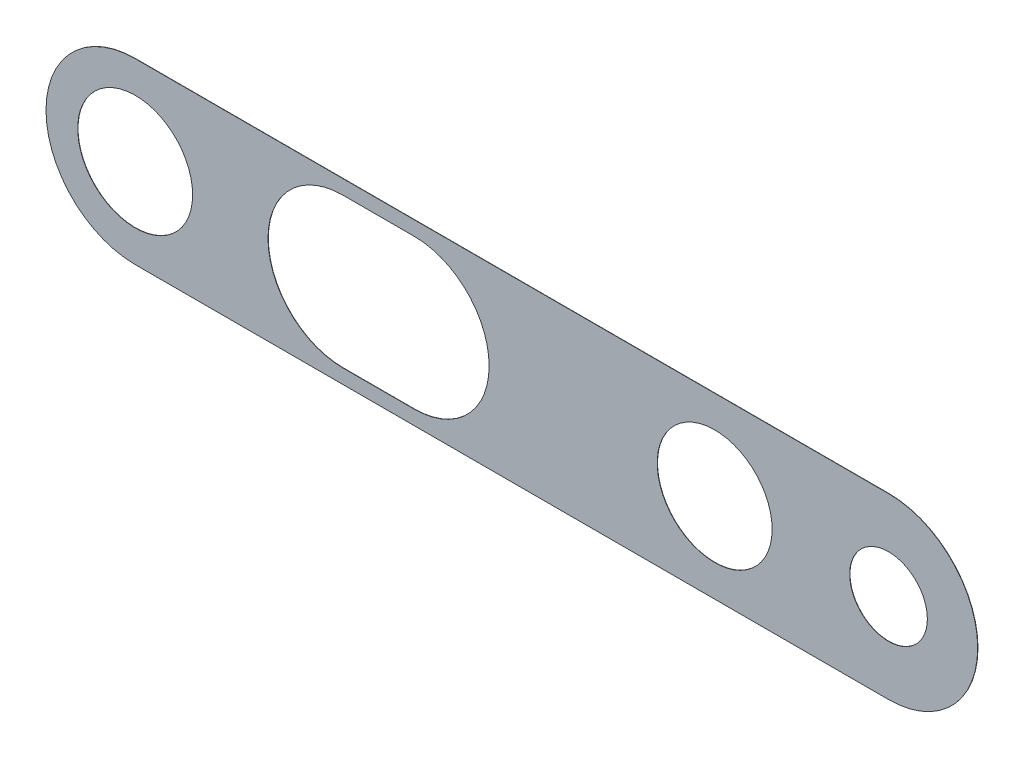
ISO-10303-21;
HEADER;
FILE_DESCRIPTION(('STEP AP214'),'2;1');
FILE_NAME('part.step','',(''),(''),'','','');
FILE_SCHEMA(('AUTOMOTIVE_DESIGN { 1 0 10303 214 1 1 1 1 }'));
ENDSEC;
DATA;
#1=APPLICATION_CONTEXT('core data for automotive mechanical design processes');
#2=APPLICATION_PROTOCOL_DEFINITION('international standard','automotive_design',2000,#1);
#3=PRODUCT_CONTEXT('',#1,'mechanical');
#4=PRODUCT('Part','Part','',(#3));
#5=PRODUCT_RELATED_PRODUCT_CATEGORY('part','',(#4));
#6=PRODUCT_DEFINITION_FORMATION('','',#4);
#7=PRODUCT_DEFINITION_CONTEXT('part definition',#1,'design');
#8=PRODUCT_DEFINITION('design','',#6,#7);
#9=PRODUCT_DEFINITION_SHAPE('','',#8);
#10=(LENGTH_UNIT() NAMED_UNIT(*) SI_UNIT(.MILLI.,.METRE.));
#11=(NAMED_UNIT(*) PLANE_ANGLE_UNIT() SI_UNIT($,.RADIAN.));
#12=(NAMED_UNIT(*) SI_UNIT($,.STERADIAN.) SOLID_ANGLE_UNIT());
#13=UNCERTAINTY_MEASURE_WITH_UNIT(LENGTH_MEASURE(1.E-05),#10,'distance_accuracy_value','');
#14=(GEOMETRIC_REPRESENTATION_CONTEXT(3) GLOBAL_UNCERTAINTY_ASSIGNED_CONTEXT((#13)) GLOBAL_UNIT_ASSIGNED_CONTEXT((#10,
#11,#12)) REPRESENTATION_CONTEXT('',''));
#15=CARTESIAN_POINT('',(0.,0.,0.));
#16=DIRECTION('',(0.,0.,1.));
#17=DIRECTION('',(1.,0.,0.));
#18=AXIS2_PLACEMENT_3D('',#15,#16,#17);
#19=CARTESIAN_POINT('',(0.,0.,-0.65));
#20=DIRECTION('',(0.,0.,1.));
#21=DIRECTION('',(1.,0.,0.));
#22=AXIS2_PLACEMENT_3D('',#19,#20,#21);
#23=PLANE('',#22);
#24=DIRECTION('',(1.,0.,0.));
#25=VECTOR('',#24,1.);
#26=CARTESIAN_POINT('',(-14.58342148133,-6.455,-0.65));
#27=LINE('',#26,#25);
#28=CARTESIAN_POINT('',(-8.416578518674,-6.455,-0.65));
#29=VERTEX_POINT('',#28);
#30=CARTESIAN_POINT('',(-14.58342148133,-6.455,-0.65));
#31=VERTEX_POINT('',#30);
#32=EDGE_CURVE('E149',#29,#31,#27,.F.);
#33=ORIENTED_EDGE('',*,*,#32,.T.);
#34=CARTESIAN_POINT('',(-14.58342148133,0.,-0.65));
#35=DIRECTION('',(0.,0.,1.));
#36=DIRECTION('',(1.,0.,0.));
#37=AXIS2_PLACEMENT_3D('',#34,#35,#36);
#38=CIRCLE('',#37,6.455);
#39=CARTESIAN_POINT('',(-14.58342148133,6.455,-0.65));
#40=VERTEX_POINT('',#39);
#41=EDGE_CURVE('E136',#31,#40,#38,.F.);
#42=ORIENTED_EDGE('',*,*,#41,.T.);
#43=DIRECTION('',(1.,0.,0.));
#44=VECTOR('',#43,1.);
#45=CARTESIAN_POINT('',(-8.416578518674,6.455,-0.65));
#46=LINE('',#45,#44);
#47=CARTESIAN_POINT('',(-8.416578518674,6.455,-0.65));
#48=VERTEX_POINT('',#47);
#49=EDGE_CURVE('E107',#40,#48,#46,.T.);
#50=ORIENTED_EDGE('',*,*,#49,.T.);
#51=CARTESIAN_POINT('',(-8.416578518674,0.,-0.65));
#52=DIRECTION('',(0.,0.,1.));
#53=DIRECTION('',(1.,0.,0.));
#54=AXIS2_PLACEMENT_3D('',#51,#52,#53);
#55=CIRCLE('',#54,6.455);
#56=EDGE_CURVE('E131',#48,#29,#55,.F.);
#57=ORIENTED_EDGE('',*,*,#56,.T.);
#58=EDGE_LOOP('',(#33,#42,#50,#57));
#59=FACE_BOUND('',#58,.T.);
#60=CARTESIAN_POINT('',(32.5,0.,-0.65));
#61=DIRECTION('',(0.,0.,1.));
#62=DIRECTION('',(1.,0.,0.));
#63=AXIS2_PLACEMENT_3D('',#60,#61,#62);
#64=CIRCLE('',#63,3.350253178006);
#65=CARTESIAN_POINT('',(35.850253178006,0.,-0.65));
#66=VERTEX_POINT('',#65);
#67=EDGE_CURVE('E139',#66,#66,#64,.F.);
#68=ORIENTED_EDGE('',*,*,#67,.T.);
#69=EDGE_LOOP('',(#68));
#70=FACE_BOUND('',#69,.T.);
#71=CARTESIAN_POINT('',(17.5,0.,-0.65));
#72=DIRECTION('',(0.,0.,1.));
#73=DIRECTION('',(1.,0.,0.));
#74=AXIS2_PLACEMENT_3D('',#71,#72,#73);
#75=CIRCLE('',#74,4.956671541071);
#76=CARTESIAN_POINT('',(22.456671541071,0.,-0.65));
#77=VERTEX_POINT('',#76);
#78=EDGE_CURVE('E103',#77,#77,#75,.F.);
#79=ORIENTED_EDGE('',*,*,#78,.T.);
#80=EDGE_LOOP('',(#79));
#81=FACE_BOUND('',#80,.T.);
#82=CARTESIAN_POINT('',(-32.5,0.,-0.65));
#83=DIRECTION('',(0.,0.,1.));
#84=DIRECTION('',(1.,0.,0.));
#85=AXIS2_PLACEMENT_3D('',#82,#83,#84);
#86=CIRCLE('',#85,4.956671541071);
#87=CARTESIAN_POINT('',(-27.543328458929,0.,-0.65));
#88=VERTEX_POINT('',#87);
#89=EDGE_CURVE('E100',#88,#88,#86,.F.);
#90=ORIENTED_EDGE('',*,*,#89,.T.);
#91=EDGE_LOOP('',(#90));
#92=FACE_BOUND('',#91,.T.);
#93=CARTESIAN_POINT('',(32.5,0.,-0.65));
#94=DIRECTION('',(0.,0.,1.));
#95=DIRECTION('',(1.,0.,0.));
#96=AXIS2_PLACEMENT_3D('',#93,#94,#95);
#97=CIRCLE('',#96,7.695);
#98=CARTESIAN_POINT('',(32.5,7.695,-0.65));
#99=VERTEX_POINT('',#98);
#100=CARTESIAN_POINT('',(32.5,-7.695,-0.65));
#101=VERTEX_POINT('',#100);
#102=EDGE_CURVE('E20',#99,#101,#97,.F.);
#103=ORIENTED_EDGE('',*,*,#102,.F.);
#104=DIRECTION('',(1.,0.,0.));
#105=VECTOR('',#104,1.);
#106=CARTESIAN_POINT('',(32.5,7.695,-0.65));
#107=LINE('',#106,#105);
#108=CARTESIAN_POINT('',(-32.5,7.695,-0.65));
#109=VERTEX_POINT('',#108);
#110=EDGE_CURVE('E109',#109,#99,#107,.T.);
#111=ORIENTED_EDGE('',*,*,#110,.F.);
#112=CARTESIAN_POINT('',(-32.5,0.,-0.65));
#113=DIRECTION('',(0.,0.,1.));
#114=DIRECTION('',(1.,0.,0.));
#115=AXIS2_PLACEMENT_3D('',#112,#113,#114);
#116=CIRCLE('',#115,7.695);
#117=CARTESIAN_POINT('',(-32.5,-7.695,-0.65));
#118=VERTEX_POINT('',#117);
#119=EDGE_CURVE('E99',#118,#109,#116,.F.);
#120=ORIENTED_EDGE('',*,*,#119,.F.);
#121=DIRECTION('',(1.,0.,0.));
#122=VECTOR('',#121,1.);
#123=CARTESIAN_POINT('',(-32.5,-7.695,-0.65));
#124=LINE('',#123,#122);
#125=EDGE_CURVE('E92',#101,#118,#124,.F.);
#126=ORIENTED_EDGE('',*,*,#125,.F.);
#127=EDGE_LOOP('',(#103,#111,#120,#126));
#128=FACE_BOUND('',#127,.T.);
#129=ADVANCED_FACE('F17',(#59,#70,#81,#92,#128),#23,.T.);
#130=CARTESIAN_POINT('',(32.5,0.,-0.65));
#131=DIRECTION('',(0.,0.,1.));
#132=DIRECTION('',(1.,0.,0.));
#133=AXIS2_PLACEMENT_3D('',#130,#131,#132);
#134=CYLINDRICAL_SURFACE('',#133,7.695);
#135=DIRECTION('',(0.,0.,1.));
#136=VECTOR('',#135,1.);
#137=CARTESIAN_POINT('',(32.5,7.695,-0.65));
#138=LINE('',#137,#136);
#139=CARTESIAN_POINT('',(32.5,7.695,-0.675));
#140=VERTEX_POINT('',#139);
#141=EDGE_CURVE('E84',#99,#140,#138,.F.);
#142=ORIENTED_EDGE('',*,*,#141,.F.);
#143=ORIENTED_EDGE('',*,*,#102,.T.);
#144=DIRECTION('',(0.,0.,-1.));
#145=VECTOR('',#144,1.);
#146=CARTESIAN_POINT('',(32.5,-7.695,-0.65));
#147=LINE('',#146,#145);
#148=CARTESIAN_POINT('',(32.5,-7.695,-0.675));
#149=VERTEX_POINT('',#148);
#150=EDGE_CURVE('E81',#149,#101,#147,.F.);
#151=ORIENTED_EDGE('',*,*,#150,.F.);
#152=CARTESIAN_POINT('',(32.5,0.,-0.675));
#153=DIRECTION('',(0.,0.,1.));
#154=DIRECTION('',(1.,0.,0.));
#155=AXIS2_PLACEMENT_3D('',#152,#153,#154);
#156=CIRCLE('',#155,7.695);
#157=EDGE_CURVE('E128',#149,#140,#156,.T.);
#158=ORIENTED_EDGE('',*,*,#157,.T.);
#159=EDGE_LOOP('',(#142,#143,#151,#158));
#160=FACE_BOUND('',#159,.T.);
#161=ADVANCED_FACE('F80',(#160),#134,.T.);
#162=CARTESIAN_POINT('',(32.5,7.695,-0.65));
#163=DIRECTION('',(0.,1.,0.));
#164=DIRECTION('',(0.,0.,1.));
#165=AXIS2_PLACEMENT_3D('',#162,#163,#164);
#166=PLANE('',#165);
#167=DIRECTION('',(0.,0.,1.));
#168=VECTOR('',#167,1.);
#169=CARTESIAN_POINT('',(-32.5,7.695,-0.65));
#170=LINE('',#169,#168);
#171=CARTESIAN_POINT('',(-32.5,7.695,-0.675));
#172=VERTEX_POINT('',#171);
#173=EDGE_CURVE('E111',#109,#172,#170,.F.);
#174=ORIENTED_EDGE('',*,*,#173,.F.);
#175=ORIENTED_EDGE('',*,*,#110,.T.);
#176=ORIENTED_EDGE('',*,*,#141,.T.);
#177=DIRECTION('',(1.,0.,0.));
#178=VECTOR('',#177,1.);
#179=CARTESIAN_POINT('',(0.,7.695,-0.675));
#180=LINE('',#179,#178);
#181=EDGE_CURVE('E127',#140,#172,#180,.F.);
#182=ORIENTED_EDGE('',*,*,#181,.T.);
#183=EDGE_LOOP('',(#174,#175,#176,#182));
#184=FACE_BOUND('',#183,.T.);
#185=ADVANCED_FACE('F270',(#184),#166,.T.);
#186=CARTESIAN_POINT('',(-32.5,0.,-0.65));
#187=DIRECTION('',(0.,0.,1.));
#188=DIRECTION('',(1.,0.,0.));
#189=AXIS2_PLACEMENT_3D('',#186,#187,#188);
#190=CYLINDRICAL_SURFACE('',#189,7.695);
#191=DIRECTION('',(0.,0.,-1.));
#192=VECTOR('',#191,1.);
#193=CARTESIAN_POINT('',(-32.5,-7.695,-0.65));
#194=LINE('',#193,#192);
#195=CARTESIAN_POINT('',(-32.5,-7.695,-0.675));
#196=VERTEX_POINT('',#195);
#197=EDGE_CURVE('E96',#118,#196,#194,.T.);
#198=ORIENTED_EDGE('',*,*,#197,.F.);
#199=ORIENTED_EDGE('',*,*,#119,.T.);
#200=ORIENTED_EDGE('',*,*,#173,.T.);
#201=CARTESIAN_POINT('',(-32.5,0.,-0.675));
#202=DIRECTION('',(0.,0.,1.));
#203=DIRECTION('',(1.,0.,0.));
#204=AXIS2_PLACEMENT_3D('',#201,#202,#203);
#205=CIRCLE('',#204,7.695);
#206=EDGE_CURVE('E125',#172,#196,#205,.T.);
#207=ORIENTED_EDGE('',*,*,#206,.T.);
#208=EDGE_LOOP('',(#198,#199,#200,#207));
#209=FACE_BOUND('',#208,.T.);
#210=ADVANCED_FACE('F262',(#209),#190,.T.);
#211=CARTESIAN_POINT('',(-32.5,-7.695,-0.65));
#212=DIRECTION('',(0.,-1.,0.));
#213=DIRECTION('',(0.,0.,-1.));
#214=AXIS2_PLACEMENT_3D('',#211,#212,#213);
#215=PLANE('',#214);
#216=ORIENTED_EDGE('',*,*,#150,.T.);
#217=ORIENTED_EDGE('',*,*,#125,.T.);
#218=ORIENTED_EDGE('',*,*,#197,.T.);
#219=DIRECTION('',(1.,0.,0.));
#220=VECTOR('',#219,1.);
#221=CARTESIAN_POINT('',(0.,-7.695,-0.675));
#222=LINE('',#221,#220);
#223=EDGE_CURVE('E95',#196,#149,#222,.T.);
#224=ORIENTED_EDGE('',*,*,#223,.T.);
#225=EDGE_LOOP('',(#216,#217,#218,#224));
#226=FACE_BOUND('',#225,.T.);
#227=ADVANCED_FACE('F90',(#226),#215,.T.);
#228=CARTESIAN_POINT('',(-32.5,0.,0.));
#229=DIRECTION('',(0.,0.,1.));
#230=DIRECTION('',(1.,0.,0.));
#231=AXIS2_PLACEMENT_3D('',#228,#229,#230);
#232=CYLINDRICAL_SURFACE('',#231,4.956671541071);
#233=CARTESIAN_POINT('',(-32.5,0.,-0.675));
#234=DIRECTION('',(0.,0.,1.));
#235=DIRECTION('',(1.,0.,0.));
#236=AXIS2_PLACEMENT_3D('',#233,#234,#235);
#237=CIRCLE('',#236,4.956671541071);
#238=CARTESIAN_POINT('',(-27.543328458929,0.,-0.675));
#239=VERTEX_POINT('',#238);
#240=EDGE_CURVE('E122',#239,#239,#237,.F.);
#241=ORIENTED_EDGE('',*,*,#240,.T.);
#242=EDGE_LOOP('',(#241));
#243=FACE_BOUND('',#242,.T.);
#244=ORIENTED_EDGE('',*,*,#89,.F.);
#245=EDGE_LOOP('',(#244));
#246=FACE_BOUND('',#245,.T.);
#247=ADVANCED_FACE('F245',(#243,#246),#232,.F.);
#248=CARTESIAN_POINT('',(17.5,0.,0.));
#249=DIRECTION('',(0.,0.,1.));
#250=DIRECTION('',(1.,0.,0.));
#251=AXIS2_PLACEMENT_3D('',#248,#249,#250);
#252=CYLINDRICAL_SURFACE('',#251,4.956671541071);
#253=CARTESIAN_POINT('',(17.5,0.,-0.675));
#254=DIRECTION('',(0.,0.,1.));
#255=DIRECTION('',(1.,0.,0.));
#256=AXIS2_PLACEMENT_3D('',#253,#254,#255);
#257=CIRCLE('',#256,4.956671541071);
#258=CARTESIAN_POINT('',(22.456671541071,0.,-0.675));
#259=VERTEX_POINT('',#258);
#260=EDGE_CURVE('E119',#259,#259,#257,.F.);
#261=ORIENTED_EDGE('',*,*,#260,.T.);
#262=EDGE_LOOP('',(#261));
#263=FACE_BOUND('',#262,.T.);
#264=ORIENTED_EDGE('',*,*,#78,.F.);
#265=EDGE_LOOP('',(#264));
#266=FACE_BOUND('',#265,.T.);
#267=ADVANCED_FACE('F190',(#263,#266),#252,.F.);
#268=CARTESIAN_POINT('',(32.5,0.,0.));
#269=DIRECTION('',(0.,0.,1.));
#270=DIRECTION('',(1.,0.,0.));
#271=AXIS2_PLACEMENT_3D('',#268,#269,#270);
#272=CYLINDRICAL_SURFACE('',#271,3.350253178006);
#273=CARTESIAN_POINT('',(32.5,0.,-0.675));
#274=DIRECTION('',(0.,0.,1.));
#275=DIRECTION('',(1.,0.,0.));
#276=AXIS2_PLACEMENT_3D('',#273,#274,#275);
#277=CIRCLE('',#276,3.350253178006);
#278=CARTESIAN_POINT('',(35.850253178006,0.,-0.675));
#279=VERTEX_POINT('',#278);
#280=EDGE_CURVE('E116',#279,#279,#277,.F.);
#281=ORIENTED_EDGE('',*,*,#280,.T.);
#282=EDGE_LOOP('',(#281));
#283=FACE_BOUND('',#282,.T.);
#284=ORIENTED_EDGE('',*,*,#67,.F.);
#285=EDGE_LOOP('',(#284));
#286=FACE_BOUND('',#285,.T.);
#287=ADVANCED_FACE('F182',(#283,#286),#272,.F.);
#288=CARTESIAN_POINT('',(-14.58342148133,0.,0.));
#289=DIRECTION('',(0.,0.,1.));
#290=DIRECTION('',(1.,0.,0.));
#291=AXIS2_PLACEMENT_3D('',#288,#289,#290);
#292=CYLINDRICAL_SURFACE('',#291,6.455);
#293=CARTESIAN_POINT('',(-14.58342148133,0.,-0.675));
#294=DIRECTION('',(0.,0.,1.));
#295=DIRECTION('',(1.,0.,0.));
#296=AXIS2_PLACEMENT_3D('',#293,#294,#295);
#297=CIRCLE('',#296,6.455);
#298=CARTESIAN_POINT('',(-14.58342148133,-6.455,-0.675));
#299=VERTEX_POINT('',#298);
#300=CARTESIAN_POINT('',(-14.58342148133,6.455,-0.675));
#301=VERTEX_POINT('',#300);
#302=EDGE_CURVE('E114',#299,#301,#297,.F.);
#303=ORIENTED_EDGE('',*,*,#302,.T.);
#304=DIRECTION('',(0.,0.,1.));
#305=VECTOR('',#304,1.);
#306=CARTESIAN_POINT('',(-14.58342148133,6.455,0.));
#307=LINE('',#306,#305);
#308=EDGE_CURVE('E135',#301,#40,#307,.T.);
#309=ORIENTED_EDGE('',*,*,#308,.T.);
#310=ORIENTED_EDGE('',*,*,#41,.F.);
#311=DIRECTION('',(0.,0.,-1.));
#312=VECTOR('',#311,1.);
#313=CARTESIAN_POINT('',(-14.58342148133,-6.455,0.));
#314=LINE('',#313,#312);
#315=EDGE_CURVE('E151',#31,#299,#314,.T.);
#316=ORIENTED_EDGE('',*,*,#315,.T.);
#317=EDGE_LOOP('',(#303,#309,#310,#316));
#318=FACE_BOUND('',#317,.T.);
#319=ADVANCED_FACE('F180',(#318),#292,.F.);
#320=CARTESIAN_POINT('',(-8.416578518674,6.455,0.));
#321=DIRECTION('',(0.,1.,0.));
#322=DIRECTION('',(0.,0.,1.));
#323=AXIS2_PLACEMENT_3D('',#320,#321,#322);
#324=PLANE('',#323);
#325=DIRECTION('',(1.,0.,0.));
#326=VECTOR('',#325,1.);
#327=CARTESIAN_POINT('',(0.,6.455,-0.675));
#328=LINE('',#327,#326);
#329=CARTESIAN_POINT('',(-8.416578518674,6.455,-0.675));
#330=VERTEX_POINT('',#329);
#331=EDGE_CURVE('E113',#301,#330,#328,.T.);
#332=ORIENTED_EDGE('',*,*,#331,.T.);
#333=DIRECTION('',(0.,0.,1.));
#334=VECTOR('',#333,1.);
#335=CARTESIAN_POINT('',(-8.416578518674,6.455,0.));
#336=LINE('',#335,#334);
#337=EDGE_CURVE('E134',#330,#48,#336,.T.);
#338=ORIENTED_EDGE('',*,*,#337,.T.);
#339=ORIENTED_EDGE('',*,*,#49,.F.);
#340=ORIENTED_EDGE('',*,*,#308,.F.);
#341=EDGE_LOOP('',(#332,#338,#339,#340));
#342=FACE_BOUND('',#341,.T.);
#343=ADVANCED_FACE('F166',(#342),#324,.F.);
#344=CARTESIAN_POINT('',(-8.416578518674,0.,0.));
#345=DIRECTION('',(0.,0.,1.));
#346=DIRECTION('',(1.,0.,0.));
#347=AXIS2_PLACEMENT_3D('',#344,#345,#346);
#348=CYLINDRICAL_SURFACE('',#347,6.455);
#349=CARTESIAN_POINT('',(-8.416578518674,0.,-0.675));
#350=DIRECTION('',(0.,0.,1.));
#351=DIRECTION('',(1.,0.,0.));
#352=AXIS2_PLACEMENT_3D('',#349,#350,#351);
#353=CIRCLE('',#352,6.455);
#354=CARTESIAN_POINT('',(-8.416578518674,-6.455,-0.675));
#355=VERTEX_POINT('',#354);
#356=EDGE_CURVE('E26',#330,#355,#353,.F.);
#357=ORIENTED_EDGE('',*,*,#356,.T.);
#358=DIRECTION('',(0.,0.,-1.));
#359=VECTOR('',#358,1.);
#360=CARTESIAN_POINT('',(-8.416578518674,-6.455,0.));
#361=LINE('',#360,#359);
#362=EDGE_CURVE('E130',#355,#29,#361,.F.);
#363=ORIENTED_EDGE('',*,*,#362,.T.);
#364=ORIENTED_EDGE('',*,*,#56,.F.);
#365=ORIENTED_EDGE('',*,*,#337,.F.);
#366=EDGE_LOOP('',(#357,#363,#364,#365));
#367=FACE_BOUND('',#366,.T.);
#368=ADVANCED_FACE('F176',(#367),#348,.F.);
#369=CARTESIAN_POINT('',(-14.58342148133,-6.455,0.));
#370=DIRECTION('',(0.,-1.,0.));
#371=DIRECTION('',(0.,0.,-1.));
#372=AXIS2_PLACEMENT_3D('',#369,#370,#371);
#373=PLANE('',#372);
#374=DIRECTION('',(1.,0.,0.));
#375=VECTOR('',#374,1.);
#376=CARTESIAN_POINT('',(0.,-6.455,-0.675));
#377=LINE('',#376,#375);
#378=EDGE_CURVE('E11',#355,#299,#377,.F.);
#379=ORIENTED_EDGE('',*,*,#378,.T.);
#380=ORIENTED_EDGE('',*,*,#315,.F.);
#381=ORIENTED_EDGE('',*,*,#32,.F.);
#382=ORIENTED_EDGE('',*,*,#362,.F.);
#383=EDGE_LOOP('',(#379,#380,#381,#382));
#384=FACE_BOUND('',#383,.T.);
#385=ADVANCED_FACE('F178',(#384),#373,.F.);
#386=CARTESIAN_POINT('',(0.,0.,-0.675));
#387=DIRECTION('',(0.,0.,1.));
#388=DIRECTION('',(1.,0.,0.));
#389=AXIS2_PLACEMENT_3D('',#386,#387,#388);
#390=PLANE('',#389);
#391=ORIENTED_EDGE('',*,*,#378,.F.);
#392=ORIENTED_EDGE('',*,*,#356,.F.);
#393=ORIENTED_EDGE('',*,*,#331,.F.);
#394=ORIENTED_EDGE('',*,*,#302,.F.);
#395=EDGE_LOOP('',(#391,#392,#393,#394));
#396=FACE_BOUND('',#395,.T.);
#397=ORIENTED_EDGE('',*,*,#280,.F.);
#398=EDGE_LOOP('',(#397));
#399=FACE_BOUND('',#398,.T.);
#400=ORIENTED_EDGE('',*,*,#260,.F.);
#401=EDGE_LOOP('',(#400));
#402=FACE_BOUND('',#401,.T.);
#403=ORIENTED_EDGE('',*,*,#240,.F.);
#404=EDGE_LOOP('',(#403));
#405=FACE_BOUND('',#404,.T.);
#406=ORIENTED_EDGE('',*,*,#223,.F.);
#407=ORIENTED_EDGE('',*,*,#206,.F.);
#408=ORIENTED_EDGE('',*,*,#181,.F.);
#409=ORIENTED_EDGE('',*,*,#157,.F.);
#410=EDGE_LOOP('',(#406,#407,#408,#409));
#411=FACE_BOUND('',#410,.T.);
#412=ADVANCED_FACE('F170',(#396,#399,#402,#405,#411),#390,.F.);
#413=CLOSED_SHELL('',(#129,#161,#185,#210,#227,#247,#267,#287,#319,#343,#368,#385,#412));
#414=MANIFOLD_SOLID_BREP('B1',#413);
#415=ADVANCED_BREP_SHAPE_REPRESENTATION('',(#18,#414),#14);
#416=SHAPE_DEFINITION_REPRESENTATION(#9,#415);
ENDSEC;
END-ISO-10303-21;
